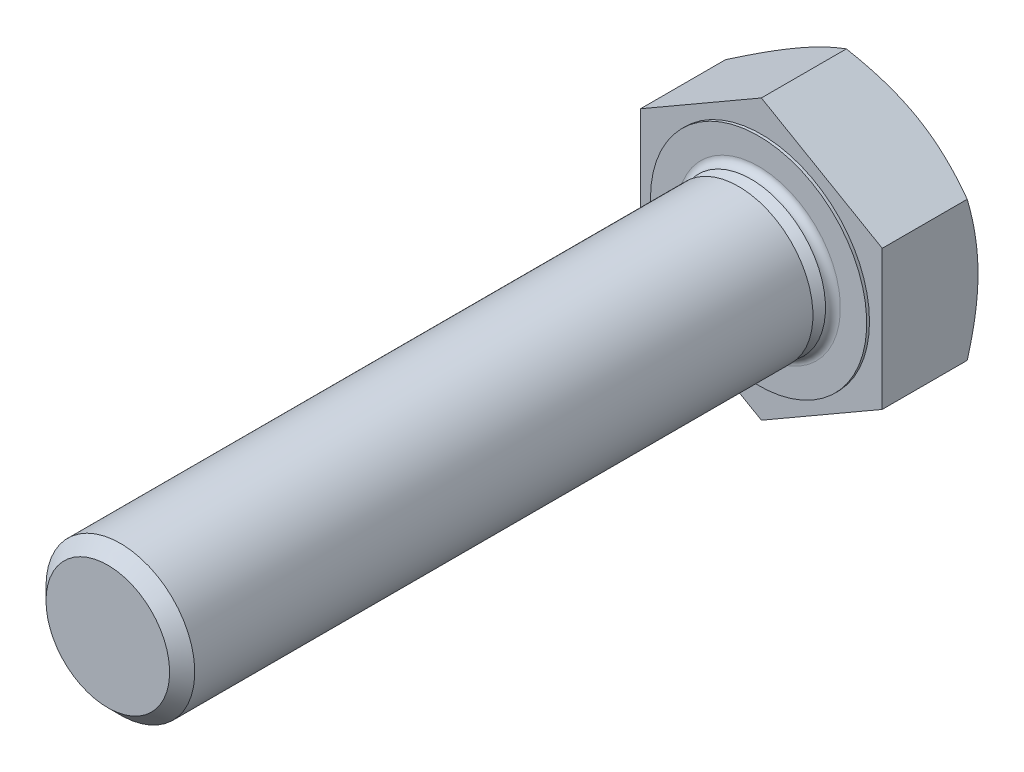
ISO-10303-21;
HEADER;
FILE_DESCRIPTION(('STEP AP214'),'2;1');
FILE_NAME('part.step','',(''),(''),'','','');
FILE_SCHEMA(('AUTOMOTIVE_DESIGN { 1 0 10303 214 1 1 1 1 }'));
ENDSEC;
DATA;
#1=APPLICATION_CONTEXT('core data for automotive mechanical design processes');
#2=APPLICATION_PROTOCOL_DEFINITION('international standard','automotive_design',2000,#1);
#3=PRODUCT_CONTEXT('',#1,'mechanical');
#4=PRODUCT('Part','Part','',(#3));
#5=PRODUCT_RELATED_PRODUCT_CATEGORY('part','',(#4));
#6=PRODUCT_DEFINITION_FORMATION('','',#4);
#7=PRODUCT_DEFINITION_CONTEXT('part definition',#1,'design');
#8=PRODUCT_DEFINITION('design','',#6,#7);
#9=PRODUCT_DEFINITION_SHAPE('','',#8);
#10=(LENGTH_UNIT() NAMED_UNIT(*) SI_UNIT(.MILLI.,.METRE.));
#11=(NAMED_UNIT(*) PLANE_ANGLE_UNIT() SI_UNIT($,.RADIAN.));
#12=(NAMED_UNIT(*) SI_UNIT($,.STERADIAN.) SOLID_ANGLE_UNIT());
#13=UNCERTAINTY_MEASURE_WITH_UNIT(LENGTH_MEASURE(1.E-05),#10,'distance_accuracy_value','');
#14=(GEOMETRIC_REPRESENTATION_CONTEXT(3) GLOBAL_UNCERTAINTY_ASSIGNED_CONTEXT((#13)) GLOBAL_UNIT_ASSIGNED_CONTEXT((#10,
#11,#12)) REPRESENTATION_CONTEXT('',''));
#15=CARTESIAN_POINT('',(0.,0.,0.));
#16=DIRECTION('',(0.,0.,1.));
#17=DIRECTION('',(1.,0.,0.));
#18=AXIS2_PLACEMENT_3D('',#15,#16,#17);
#19=CARTESIAN_POINT('',(0.,0.,35.));
#20=DIRECTION('',(0.,0.,-1.));
#21=DIRECTION('',(-1.,0.,0.));
#22=AXIS2_PLACEMENT_3D('',#19,#20,#21);
#23=PLANE('',#22);
#24=CARTESIAN_POINT('',(0.,0.,35.));
#25=DIRECTION('',(0.,0.,-1.));
#26=DIRECTION('',(-1.,0.,0.));
#27=AXIS2_PLACEMENT_3D('',#24,#25,#26);
#28=CIRCLE('',#27,3.3234375);
#29=CARTESIAN_POINT('',(-3.3234375,0.,35.));
#30=VERTEX_POINT('',#29);
#31=EDGE_CURVE('E11',#30,#30,#28,.T.);
#32=ORIENTED_EDGE('',*,*,#31,.F.);
#33=EDGE_LOOP('',(#32));
#34=FACE_BOUND('',#33,.T.);
#35=ADVANCED_FACE('F17',(#34),#23,.F.);
#36=CARTESIAN_POINT('',(0.,0.,35.));
#37=DIRECTION('',(0.,0.,-1.));
#38=DIRECTION('',(-1.,0.,0.));
#39=AXIS2_PLACEMENT_3D('',#36,#37,#38);
#40=CONICAL_SURFACE('',#39,3.3234375,0.785398163397447);
#41=CARTESIAN_POINT('',(0.,0.,34.3234375));
#42=DIRECTION('',(0.,0.,-1.));
#43=DIRECTION('',(-1.,0.,0.));
#44=AXIS2_PLACEMENT_3D('',#41,#42,#43);
#45=CIRCLE('',#44,4.);
#46=CARTESIAN_POINT('',(-4.,0.,34.3234375));
#47=VERTEX_POINT('',#46);
#48=EDGE_CURVE('E26',#47,#47,#45,.T.);
#49=ORIENTED_EDGE('',*,*,#48,.F.);
#50=EDGE_LOOP('',(#49));
#51=FACE_BOUND('',#50,.T.);
#52=ORIENTED_EDGE('',*,*,#31,.T.);
#53=EDGE_LOOP('',(#52));
#54=FACE_BOUND('',#53,.T.);
#55=ADVANCED_FACE('F209',(#51,#54),#40,.T.);
#56=CARTESIAN_POINT('',(0.,0.,-0.65));
#57=DIRECTION('',(0.,0.,-1.));
#58=DIRECTION('',(-1.,0.,0.));
#59=AXIS2_PLACEMENT_3D('',#56,#57,#58);
#60=CYLINDRICAL_SURFACE('',#59,4.);
#61=CARTESIAN_POINT('',(0.,0.,1.0765625));
#62=DIRECTION('',(0.,0.,-1.));
#63=DIRECTION('',(-1.,0.,0.));
#64=AXIS2_PLACEMENT_3D('',#61,#62,#63);
#65=CIRCLE('',#64,4.);
#66=CARTESIAN_POINT('',(-4.,0.,1.0765625));
#67=VERTEX_POINT('',#66);
#68=EDGE_CURVE('E224',#67,#67,#65,.T.);
#69=ORIENTED_EDGE('',*,*,#68,.F.);
#70=EDGE_LOOP('',(#69));
#71=FACE_BOUND('',#70,.T.);
#72=ORIENTED_EDGE('',*,*,#48,.T.);
#73=EDGE_LOOP('',(#72));
#74=FACE_BOUND('',#73,.T.);
#75=ADVANCED_FACE('F206',(#71,#74),#60,.T.);
#76=CARTESIAN_POINT('',(0.,4.,1.0765625));
#77=DIRECTION('',(0.,0.,1.));
#78=DIRECTION('',(1.,0.,0.));
#79=AXIS2_PLACEMENT_3D('',#76,#77,#78);
#80=PLANE('',#79);
#81=CARTESIAN_POINT('',(0.,0.,1.0765625));
#82=DIRECTION('',(0.,0.,-1.));
#83=DIRECTION('',(-1.,0.,0.));
#84=AXIS2_PLACEMENT_3D('',#81,#82,#83);
#85=CIRCLE('',#84,3.3234375);
#86=CARTESIAN_POINT('',(-3.3234375,0.,1.0765625));
#87=VERTEX_POINT('',#86);
#88=EDGE_CURVE('E231',#87,#87,#85,.T.);
#89=ORIENTED_EDGE('',*,*,#88,.F.);
#90=EDGE_LOOP('',(#89));
#91=FACE_BOUND('',#90,.T.);
#92=ORIENTED_EDGE('',*,*,#68,.T.);
#93=EDGE_LOOP('',(#92));
#94=FACE_BOUND('',#93,.T.);
#95=ADVANCED_FACE('F202',(#91,#94),#80,.F.);
#96=CARTESIAN_POINT('',(0.,0.,1.0765625));
#97=DIRECTION('',(0.,0.,-1.));
#98=DIRECTION('',(-1.,0.,0.));
#99=AXIS2_PLACEMENT_3D('',#96,#97,#98);
#100=CONICAL_SURFACE('',#99,3.3234375,0.785398163397448);
#101=CARTESIAN_POINT('',(0.,0.,0.4));
#102=DIRECTION('',(0.,0.,-1.));
#103=DIRECTION('',(-1.,0.,0.));
#104=AXIS2_PLACEMENT_3D('',#101,#102,#103);
#105=CIRCLE('',#104,4.);
#106=CARTESIAN_POINT('',(-4.,0.,0.4));
#107=VERTEX_POINT('',#106);
#108=EDGE_CURVE('E237',#107,#107,#105,.T.);
#109=ORIENTED_EDGE('',*,*,#108,.F.);
#110=EDGE_LOOP('',(#109));
#111=FACE_BOUND('',#110,.T.);
#112=ORIENTED_EDGE('',*,*,#88,.T.);
#113=EDGE_LOOP('',(#112));
#114=FACE_BOUND('',#113,.T.);
#115=ADVANCED_FACE('F198',(#111,#114),#100,.T.);
#116=CARTESIAN_POINT('',(0.,0.,0.4));
#117=DIRECTION('',(0.,0.,-1.));
#118=DIRECTION('',(-1.,0.,0.));
#119=AXIS2_PLACEMENT_3D('',#116,#117,#118);
#120=TOROIDAL_SURFACE('',#119,4.4,0.4);
#121=ORIENTED_EDGE('',*,*,#108,.T.);
#122=EDGE_LOOP('',(#121));
#123=FACE_BOUND('',#122,.T.);
#124=CARTESIAN_POINT('',(0.,0.,0.));
#125=DIRECTION('',(0.,0.,-1.));
#126=DIRECTION('',(-1.,0.,0.));
#127=AXIS2_PLACEMENT_3D('',#124,#125,#126);
#128=CIRCLE('',#127,4.4);
#129=CARTESIAN_POINT('',(-4.4,0.,0.));
#130=VERTEX_POINT('',#129);
#131=EDGE_CURVE('E241',#130,#130,#128,.T.);
#132=ORIENTED_EDGE('',*,*,#131,.F.);
#133=EDGE_LOOP('',(#132));
#134=FACE_BOUND('',#133,.T.);
#135=ADVANCED_FACE('F194',(#123,#134),#120,.F.);
#136=CARTESIAN_POINT('',(0.,4.4,0.));
#137=DIRECTION('',(0.,0.,-1.));
#138=DIRECTION('',(-1.,0.,0.));
#139=AXIS2_PLACEMENT_3D('',#136,#137,#138);
#140=PLANE('',#139);
#141=CARTESIAN_POINT('',(0.,0.,0.));
#142=DIRECTION('',(0.,0.,-1.));
#143=DIRECTION('',(-1.,0.,0.));
#144=AXIS2_PLACEMENT_3D('',#141,#142,#143);
#145=CIRCLE('',#144,5.815);
#146=CARTESIAN_POINT('',(-5.815,0.,0.));
#147=VERTEX_POINT('',#146);
#148=EDGE_CURVE('E244',#147,#147,#145,.T.);
#149=ORIENTED_EDGE('',*,*,#148,.F.);
#150=EDGE_LOOP('',(#149));
#151=FACE_BOUND('',#150,.T.);
#152=ORIENTED_EDGE('',*,*,#131,.T.);
#153=EDGE_LOOP('',(#152));
#154=FACE_BOUND('',#153,.T.);
#155=ADVANCED_FACE('F190',(#151,#154),#140,.F.);
#156=CARTESIAN_POINT('',(0.,0.,-0.65));
#157=DIRECTION('',(0.,0.,-1.));
#158=DIRECTION('',(-1.,0.,0.));
#159=AXIS2_PLACEMENT_3D('',#156,#157,#158);
#160=CYLINDRICAL_SURFACE('',#159,5.815);
#161=CARTESIAN_POINT('',(0.,0.,-0.15));
#162=DIRECTION('',(0.,0.,1.));
#163=DIRECTION('',(1.,0.,0.));
#164=AXIS2_PLACEMENT_3D('',#161,#162,#163);
#165=CIRCLE('',#164,5.815);
#166=CARTESIAN_POINT('',(5.815,0.,-0.15));
#167=VERTEX_POINT('',#166);
#168=EDGE_CURVE('E20',#167,#167,#165,.T.);
#169=ORIENTED_EDGE('',*,*,#168,.T.);
#170=EDGE_LOOP('',(#169));
#171=FACE_BOUND('',#170,.T.);
#172=ORIENTED_EDGE('',*,*,#148,.T.);
#173=EDGE_LOOP('',(#172));
#174=FACE_BOUND('',#173,.T.);
#175=ADVANCED_FACE('F187',(#171,#174),#160,.T.);
#176=CARTESIAN_POINT('',(0.,0.,-0.15));
#177=DIRECTION('',(0.,0.,1.));
#178=DIRECTION('',(-1.,0.,0.));
#179=AXIS2_PLACEMENT_3D('',#176,#177,#178);
#180=PLANE('',#179);
#181=DIRECTION('',(0.866025403784439,-0.5,0.));
#182=VECTOR('',#181,1.);
#183=CARTESIAN_POINT('',(0.,-7.50555349946514,-0.15));
#184=LINE('',#183,#182);
#185=CARTESIAN_POINT('',(-6.5,-3.75277674973257,-0.15));
#186=VERTEX_POINT('',#185);
#187=CARTESIAN_POINT('',(0.,-7.50555349946514,-0.15));
#188=VERTEX_POINT('',#187);
#189=EDGE_CURVE('E268',#186,#188,#184,.T.);
#190=ORIENTED_EDGE('',*,*,#189,.T.);
#191=DIRECTION('',(0.866025403784439,0.5,0.));
#192=VECTOR('',#191,1.);
#193=CARTESIAN_POINT('',(6.5,-3.75277674973256,-0.15));
#194=LINE('',#193,#192);
#195=CARTESIAN_POINT('',(6.5,-3.75277674973256,-0.15));
#196=VERTEX_POINT('',#195);
#197=EDGE_CURVE('E101',#188,#196,#194,.T.);
#198=ORIENTED_EDGE('',*,*,#197,.T.);
#199=DIRECTION('',(0.,1.,0.));
#200=VECTOR('',#199,1.);
#201=CARTESIAN_POINT('',(6.5,3.75277674973257,-0.15));
#202=LINE('',#201,#200);
#203=CARTESIAN_POINT('',(6.5,3.75277674973257,-0.15));
#204=VERTEX_POINT('',#203);
#205=EDGE_CURVE('E97',#196,#204,#202,.T.);
#206=ORIENTED_EDGE('',*,*,#205,.T.);
#207=DIRECTION('',(-0.866025403784439,0.5,0.));
#208=VECTOR('',#207,1.);
#209=CARTESIAN_POINT('',(0.,7.50555349946514,-0.15));
#210=LINE('',#209,#208);
#211=CARTESIAN_POINT('',(0.,7.50555349946514,-0.15));
#212=VERTEX_POINT('',#211);
#213=EDGE_CURVE('E109',#204,#212,#210,.T.);
#214=ORIENTED_EDGE('',*,*,#213,.T.);
#215=DIRECTION('',(-0.866025403784439,-0.5,0.));
#216=VECTOR('',#215,1.);
#217=CARTESIAN_POINT('',(-6.5,3.75277674973256,-0.15));
#218=LINE('',#217,#216);
#219=CARTESIAN_POINT('',(-6.5,3.75277674973256,-0.15));
#220=VERTEX_POINT('',#219);
#221=EDGE_CURVE('E293',#212,#220,#218,.T.);
#222=ORIENTED_EDGE('',*,*,#221,.T.);
#223=DIRECTION('',(0.,-1.,0.));
#224=VECTOR('',#223,1.);
#225=CARTESIAN_POINT('',(-6.5,-3.75277674973257,-0.15));
#226=LINE('',#225,#224);
#227=EDGE_CURVE('E272',#220,#186,#226,.T.);
#228=ORIENTED_EDGE('',*,*,#227,.T.);
#229=EDGE_LOOP('',(#190,#198,#206,#214,#222,#228));
#230=FACE_BOUND('',#229,.T.);
#231=ORIENTED_EDGE('',*,*,#168,.F.);
#232=EDGE_LOOP('',(#231));
#233=FACE_BOUND('',#232,.T.);
#234=ADVANCED_FACE('F142',(#230,#233),#180,.T.);
#235=CARTESIAN_POINT('',(0.,0.,-4.71831960379145));
#236=DIRECTION('',(0.,0.,1.));
#237=DIRECTION('',(-1.,0.,0.));
#238=AXIS2_PLACEMENT_3D('',#235,#236,#237);
#239=CONICAL_SURFACE('',#238,7.5075,1.0471975511966);
#240=CARTESIAN_POINT('',(0.,0.,-5.3));
#241=DIRECTION('',(0.,0.,1.));
#242=DIRECTION('',(-1.,0.,0.));
#243=AXIS2_PLACEMENT_3D('',#240,#241,#242);
#244=CIRCLE('',#243,6.5);
#245=CARTESIAN_POINT('',(-3.25,-5.62916512459885,-5.3));
#246=VERTEX_POINT('',#245);
#247=CARTESIAN_POINT('',(3.25,-5.62916512459885,-5.3));
#248=VERTEX_POINT('',#247);
#249=EDGE_CURVE('E315',#246,#248,#244,.T.);
#250=ORIENTED_EDGE('',*,*,#249,.T.);
#251=CARTESIAN_POINT('',(6.500002,-3.75277559503203,-4.71944274973241));
#252=CARTESIAN_POINT('',(6.35712620807255,-3.83526497196202,-4.76705884776377));
#253=CARTESIAN_POINT('',(6.21371770790945,-3.91806190813526,-4.81251377350587));
#254=CARTESIAN_POINT('',(5.92573609642413,-4.08432816904797,-4.89850607721118));
#255=CARTESIAN_POINT('',(5.7811625111712,-4.16779776741146,-4.93904133382286));
#256=CARTESIAN_POINT('',(5.34512711287665,-4.41954292199303,-5.05247188162342));
#257=CARTESIAN_POINT('',(5.05194417472151,-4.5888121702587,-5.11698888095725));
#258=CARTESIAN_POINT('',(4.61320127712687,-4.84212050029,-5.19264087408676));
#259=CARTESIAN_POINT('',(4.4689521086707,-4.92540279652855,-5.21419158213611));
#260=CARTESIAN_POINT('',(4.17980207578691,-5.0923436458502,-5.25032811462334));
#261=CARTESIAN_POINT('',(4.03490127008031,-5.1760021650307,-5.26491455442239));
#262=CARTESIAN_POINT('',(3.74484807874235,-5.34346445312898,-5.28675081186109));
#263=CARTESIAN_POINT('',(3.59969616666321,-5.42726794864126,-5.29400895467767));
#264=CARTESIAN_POINT('',(3.30926637478267,-5.59494766716417,-5.3010407782254));
#265=CARTESIAN_POINT('',(3.163988499013,-5.6788238878471,-5.30081469025906));
#266=CARTESIAN_POINT('',(2.76599917400351,-5.90860313177592,-5.28990852719947));
#267=CARTESIAN_POINT('',(2.51341807956326,-6.05443089464321,-5.27160906821291));
#268=CARTESIAN_POINT('',(2.0099334678803,-6.3451178707312,-5.21358751925144));
#269=CARTESIAN_POINT('',(1.75903172059244,-6.48997606206799,-5.17384560824828));
#270=CARTESIAN_POINT('',(1.25453430247847,-6.78124778222157,-5.0745047971726));
#271=CARTESIAN_POINT('',(1.00100227202879,-6.92762456824988,-5.014485106267));
#272=CARTESIAN_POINT('',(0.497718540867834,-7.21819556591442,-4.87826555818941));
#273=CARTESIAN_POINT('',(0.247960397480241,-7.36239349723155,-4.8020976871334));
#274=CARTESIAN_POINT('',(-2.00000000056936E-06,-7.50555465416567,-4.71944274973241));
#275=B_SPLINE_CURVE_WITH_KNOTS('',3,(#251,#252,#253,#254,#255,#256,#257,#258,#259,#260,#261,
#262,#263,#264,#265,#266,#267,#268,#269,#270,#271,#272,#273,#274),.UNSPECIFIED.,.F.,.F.,(4,2,2,
2,2,2,2,2,2,2,2,4),(0.,0.515097230812099,1.03041578730196,2.06319381753069,2.56693508465116,
3.07063183306576,3.5737557200387,4.07686405782423,4.95263248446346,5.82921184659663,
6.72522956997887,7.61948878328294),.UNSPECIFIED.);
#276=CARTESIAN_POINT('',(0.,-7.50555349946514,-4.71944341639924));
#277=VERTEX_POINT('',#276);
#278=EDGE_CURVE('E33',#248,#277,#275,.T.);
#279=ORIENTED_EDGE('',*,*,#278,.T.);
#280=CARTESIAN_POINT('',(2.00000000078336E-06,-7.50555465416567,-4.71944274973241));
#281=CARTESIAN_POINT('',(-0.142873791927456,-7.42306527723568,-4.76705884776377));
#282=CARTESIAN_POINT('',(-0.286282292090552,-7.34026834106244,-4.81251377350587));
#283=CARTESIAN_POINT('',(-0.574263903575868,-7.17400208014973,-4.89850607721118));
#284=CARTESIAN_POINT('',(-0.718837488828803,-7.09053248178624,-4.93904133382286));
#285=CARTESIAN_POINT('',(-1.15487288712335,-6.83878732720467,-5.05247188162342));
#286=CARTESIAN_POINT('',(-1.44805582527849,-6.669518078939,-5.11698888095725));
#287=CARTESIAN_POINT('',(-1.88679872287313,-6.4162097489077,-5.19264087408676));
#288=CARTESIAN_POINT('',(-2.03104789132931,-6.33292745266914,-5.21419158213611));
#289=CARTESIAN_POINT('',(-2.32019792421309,-6.1659866033475,-5.25032811462334));
#290=CARTESIAN_POINT('',(-2.46509872991969,-6.082328084167,-5.26491455442238));
#291=CARTESIAN_POINT('',(-2.75515192125765,-5.91486579606872,-5.28675081186109));
#292=CARTESIAN_POINT('',(-2.9003038333368,-5.83106230055644,-5.29400895467766));
#293=CARTESIAN_POINT('',(-3.19073362521733,-5.66338258203352,-5.30104077822539));
#294=CARTESIAN_POINT('',(-3.33601150098701,-5.5795063613506,-5.30081469025906));
#295=CARTESIAN_POINT('',(-3.73400082599649,-5.34972711742178,-5.28990852719947));
#296=CARTESIAN_POINT('',(-3.98658192043674,-5.20389935455449,-5.2716090682129));
#297=CARTESIAN_POINT('',(-4.4900665321197,-4.9132123784665,-5.21358751925144));
#298=CARTESIAN_POINT('',(-4.74096827940756,-4.76835418712971,-5.17384560824827));
#299=CARTESIAN_POINT('',(-5.24546569752153,-4.47708246697614,-5.0745047971726));
#300=CARTESIAN_POINT('',(-5.49899772797121,-4.33070568094782,-5.014485106267));
#301=CARTESIAN_POINT('',(-6.00228145913217,-4.04013468328328,-4.8782655581894));
#302=CARTESIAN_POINT('',(-6.25203960251976,-3.89593675196616,-4.8020976871334));
#303=CARTESIAN_POINT('',(-6.500002,-3.75277559503203,-4.71944274973241));
#304=B_SPLINE_CURVE_WITH_KNOTS('',3,(#280,#281,#282,#283,#284,#285,#286,#287,#288,#289,#290,
#291,#292,#293,#294,#295,#296,#297,#298,#299,#300,#301,#302,#303),.UNSPECIFIED.,.F.,.F.,(4,2,2,
2,2,2,2,2,2,2,2,4),(0.,0.515097230812099,1.03041578730196,2.06319381753069,2.56693508465116,
3.07063183306576,3.5737557200387,4.07686405782423,4.95263248446346,5.82921184659663,
6.72522956997887,7.61948878328294),.UNSPECIFIED.);
#305=EDGE_CURVE('E172',#277,#246,#304,.T.);
#306=ORIENTED_EDGE('',*,*,#305,.T.);
#307=EDGE_LOOP('',(#250,#279,#306));
#308=FACE_BOUND('',#307,.T.);
#309=ADVANCED_FACE('F140',(#308),#239,.T.);
#310=CARTESIAN_POINT('',(6.5,0.,-5.3));
#311=VERTEX_POINT('',#310);
#312=CARTESIAN_POINT('',(3.25,5.62916512459885,-5.3));
#313=VERTEX_POINT('',#312);
#314=EDGE_CURVE('E333',#311,#313,#244,.T.);
#315=ORIENTED_EDGE('',*,*,#314,.T.);
#316=CARTESIAN_POINT('',(-2.00000000097541E-06,7.50555465416567,-4.71944274973241));
#317=CARTESIAN_POINT('',(0.142873791927456,7.42306527723568,-4.76705884776377));
#318=CARTESIAN_POINT('',(0.286282292090551,7.34026834106244,-4.81251377350587));
#319=CARTESIAN_POINT('',(0.574263903575868,7.17400208014973,-4.89850607721118));
#320=CARTESIAN_POINT('',(0.718837488828802,7.09053248178624,-4.93904133382286));
#321=CARTESIAN_POINT('',(1.15487288712335,6.83878732720467,-5.05247188162342));
#322=CARTESIAN_POINT('',(1.44805582527849,6.669518078939,-5.11698888095725));
#323=CARTESIAN_POINT('',(1.88679872287313,6.4162097489077,-5.19264087408676));
#324=CARTESIAN_POINT('',(2.03104789132931,6.33292745266914,-5.21419158213611));
#325=CARTESIAN_POINT('',(2.32019792421309,6.1659866033475,-5.25032811462334));
#326=CARTESIAN_POINT('',(2.46509872991969,6.082328084167,-5.26491455442238));
#327=CARTESIAN_POINT('',(2.75515192125765,5.91486579606872,-5.28675081186109));
#328=CARTESIAN_POINT('',(2.90030383333679,5.83106230055644,-5.29400895467766));
#329=CARTESIAN_POINT('',(3.19073362521733,5.66338258203352,-5.30104077822539));
#330=CARTESIAN_POINT('',(3.33601150098701,5.5795063613506,-5.30081469025906));
#331=CARTESIAN_POINT('',(3.73400082599649,5.34972711742178,-5.28990852719947));
#332=CARTESIAN_POINT('',(3.98658192043674,5.20389935455449,-5.2716090682129));
#333=CARTESIAN_POINT('',(4.4900665321197,4.9132123784665,-5.21358751925144));
#334=CARTESIAN_POINT('',(4.74096827940756,4.76835418712971,-5.17384560824827));
#335=CARTESIAN_POINT('',(5.24546569752153,4.47708246697614,-5.0745047971726));
#336=CARTESIAN_POINT('',(5.49899772797121,4.33070568094782,-5.014485106267));
#337=CARTESIAN_POINT('',(6.00228145913216,4.04013468328329,-4.8782655581894));
#338=CARTESIAN_POINT('',(6.25203960251976,3.89593675196616,-4.8020976871334));
#339=CARTESIAN_POINT('',(6.500002,3.75277559503204,-4.71944274973241));
#340=B_SPLINE_CURVE_WITH_KNOTS('',3,(#316,#317,#318,#319,#320,#321,#322,#323,#324,#325,#326,
#327,#328,#329,#330,#331,#332,#333,#334,#335,#336,#337,#338,#339),.UNSPECIFIED.,.F.,.F.,(4,2,2,
2,2,2,2,2,2,2,2,4),(0.,0.515097230812098,1.03041578730196,2.06319381753069,2.56693508465116,
3.07063183306576,3.5737557200387,4.07686405782423,4.95263248446345,5.82921184659662,
6.72522956997886,7.61948878328294),.UNSPECIFIED.);
#341=CARTESIAN_POINT('',(6.5,3.75277674973258,-4.71944341639923));
#342=VERTEX_POINT('',#341);
#343=EDGE_CURVE('E148',#313,#342,#340,.T.);
#344=ORIENTED_EDGE('',*,*,#343,.T.);
#345=CARTESIAN_POINT('',(6.5,9.95307285908936,-2.18950106586408));
#346=CARTESIAN_POINT('',(6.5,9.66768488978744,-2.32741694462484));
#347=CARTESIAN_POINT('',(6.5,9.38162218475458,-2.46396187262551));
#348=CARTESIAN_POINT('',(6.5,8.80778247979371,-2.73352642358591));
#349=CARTESIAN_POINT('',(6.5,8.52000519349762,-2.86654543621498));
#350=CARTESIAN_POINT('',(6.5,7.94081702987502,-3.12897547035034));
#351=CARTESIAN_POINT('',(6.5,7.64939478323307,-3.25836149012832));
#352=CARTESIAN_POINT('',(6.5,7.0641550965755,-3.51157630682606));
#353=CARTESIAN_POINT('',(6.5,6.77033778235015,-3.63540539340508));
#354=CARTESIAN_POINT('',(6.5,6.17619249466497,-3.87749909631481));
#355=CARTESIAN_POINT('',(6.5,5.875828877051,-3.99567671308662));
#356=CARTESIAN_POINT('',(6.5,5.27155865332413,-4.22277662595523));
#357=CARTESIAN_POINT('',(6.5,4.96765165730143,-4.33169789235064));
#358=CARTESIAN_POINT('',(6.5,4.35643639784011,-4.53735883659428));
#359=CARTESIAN_POINT('',(6.5,4.04913693634067,-4.63412441108149));
#360=CARTESIAN_POINT('',(6.5,3.43016616038199,-4.81233031373957));
#361=CARTESIAN_POINT('',(6.5,3.11849626203734,-4.89377548814036));
#362=CARTESIAN_POINT('',(6.5,2.49058681273854,-5.03739091972401));
#363=CARTESIAN_POINT('',(6.5,2.17434607035872,-5.099556053006));
#364=CARTESIAN_POINT('',(6.5,1.53800734029216,-5.20041039162963));
#365=CARTESIAN_POINT('',(6.5,1.21790934922361,-5.23909957638743));
#366=CARTESIAN_POINT('',(6.5,0.737252871284547,-5.27704622673573));
#367=CARTESIAN_POINT('',(6.5,0.577446868410653,-5.28634917626868));
#368=CARTESIAN_POINT('',(6.5,0.257576967669788,-5.29818345264611));
#369=CARTESIAN_POINT('',(6.5,0.0975130731795747,-5.30071486744556));
#370=CARTESIAN_POINT('',(6.5,-0.222530422340147,-5.29893807889715));
#371=CARTESIAN_POINT('',(6.5,-0.382510034418972,-5.29463179526148));
#372=CARTESIAN_POINT('',(6.5,-0.702148832131736,-5.27928875033018));
#373=CARTESIAN_POINT('',(6.5,-0.861808001361578,-5.268251652865));
#374=CARTESIAN_POINT('',(6.5,-1.2487675251381,-5.2335743026679));
#375=CARTESIAN_POINT('',(6.5,-1.47577055977927,-5.20656168522891));
#376=CARTESIAN_POINT('',(6.5,-1.92803729286359,-5.14042863403666));
#377=CARTESIAN_POINT('',(6.5,-2.15330049935344,-5.1013048955893));
#378=CARTESIAN_POINT('',(6.5,-2.60190162254787,-5.01233712827938));
#379=CARTESIAN_POINT('',(6.5,-2.82523750985594,-4.96248296370137));
#380=CARTESIAN_POINT('',(6.5,-3.26961152922598,-4.85357548053456));
#381=CARTESIAN_POINT('',(6.5,-3.49064987565262,-4.79452302853169));
#382=CARTESIAN_POINT('',(6.5,-3.93587314871608,-4.6670880522278));
#383=CARTESIAN_POINT('',(6.5,-4.16000238632251,-4.59851230201414));
#384=CARTESIAN_POINT('',(6.5,-4.60589181343481,-4.45458478908547));
#385=CARTESIAN_POINT('',(6.50000000000001,-4.82765352051654,-4.37923769993311));
#386=CARTESIAN_POINT('',(6.50000000000001,-5.26791804038342,-4.22332390471417));
#387=CARTESIAN_POINT('',(6.50000000000001,-5.48643217049916,-4.14278896471665));
#388=CARTESIAN_POINT('',(6.5,-5.92176503585598,-3.97699192799453));
#389=CARTESIAN_POINT('',(6.5,-6.13858304495037,-3.89172792084594));
#390=CARTESIAN_POINT('',(6.5,-6.35461336357442,-3.80456718200001));
#391=B_SPLINE_CURVE_WITH_KNOTS('',3,(#345,#346,#347,#348,#349,#350,#351,#352,#353,#354,#355,
#356,#357,#358,#359,#360,#361,#362,#363,#364,#365,#366,#367,#368,#369,#370,#371,#372,#373,#374,
#375,#376,#377,#378,#379,#380,#381,#382,#383,#384,#385,#386,#387,#388,#389,#390),.UNSPECIFIED.,
.F.,.F.,(4,2,2,2,2,2,2,2,2,2,2,2,2,2,2,2,2,2,2,2,2,2,4),(0.,0.950909051370077,1.90198164276349,
2.85849656625616,3.8149615726478,4.78317137315415,5.75148873932466,6.71770688363887,
7.68361887285433,8.64978734516564,9.61595666461727,10.0960644432439,10.5761659857554,
11.0561327615996,11.5361235112802,12.2215554610679,12.9071746059577,13.5934442356332,
14.2796492497687,14.982675389883,15.6852199758561,16.3838102365337,17.0826847952346),.UNSPECIFIED.);
#392=EDGE_CURVE('E114',#342,#311,#391,.T.);
#393=ORIENTED_EDGE('',*,*,#392,.T.);
#394=EDGE_LOOP('',(#315,#344,#393));
#395=FACE_BOUND('',#394,.T.);
#396=ADVANCED_FACE('F141',(#395),#239,.T.);
#397=CARTESIAN_POINT('',(-3.25,5.62916512459885,-5.3));
#398=VERTEX_POINT('',#397);
#399=EDGE_CURVE('E337',#313,#398,#244,.T.);
#400=ORIENTED_EDGE('',*,*,#399,.T.);
#401=CARTESIAN_POINT('',(-6.500002,3.75277559503203,-4.71944274973241));
#402=CARTESIAN_POINT('',(-6.35712620807255,3.83526497196203,-4.76705884776377));
#403=CARTESIAN_POINT('',(-6.21371770790945,3.91806190813527,-4.81251377350587));
#404=CARTESIAN_POINT('',(-5.92573609642413,4.08432816904798,-4.89850607721118));
#405=CARTESIAN_POINT('',(-5.7811625111712,4.16779776741147,-4.93904133382286));
#406=CARTESIAN_POINT('',(-5.34512711287665,4.41954292199303,-5.05247188162342));
#407=CARTESIAN_POINT('',(-5.05194417472151,4.5888121702587,-5.11698888095725));
#408=CARTESIAN_POINT('',(-4.61320127712688,4.84212050029,-5.19264087408676));
#409=CARTESIAN_POINT('',(-4.4689521086707,4.92540279652856,-5.21419158213611));
#410=CARTESIAN_POINT('',(-4.17980207578691,5.0923436458502,-5.25032811462334));
#411=CARTESIAN_POINT('',(-4.03490127008031,5.1760021650307,-5.26491455442239));
#412=CARTESIAN_POINT('',(-3.74484807874235,5.34346445312898,-5.28675081186109));
#413=CARTESIAN_POINT('',(-3.59969616666321,5.42726794864126,-5.29400895467766));
#414=CARTESIAN_POINT('',(-3.30926637478268,5.59494766716418,-5.30104077822539));
#415=CARTESIAN_POINT('',(-3.163988499013,5.6788238878471,-5.30081469025906));
#416=CARTESIAN_POINT('',(-2.76599917400351,5.90860313177592,-5.28990852719947));
#417=CARTESIAN_POINT('',(-2.51341807956326,6.05443089464321,-5.27160906821291));
#418=CARTESIAN_POINT('',(-2.0099334678803,6.3451178707312,-5.21358751925144));
#419=CARTESIAN_POINT('',(-1.75903172059244,6.48997606206799,-5.17384560824827));
#420=CARTESIAN_POINT('',(-1.25453430247847,6.78124778222157,-5.0745047971726));
#421=CARTESIAN_POINT('',(-1.00100227202879,6.92762456824988,-5.014485106267));
#422=CARTESIAN_POINT('',(-0.497718540867836,7.21819556591442,-4.87826555818941));
#423=CARTESIAN_POINT('',(-0.247960397480243,7.36239349723155,-4.8020976871334));
#424=CARTESIAN_POINT('',(1.99999999882913E-06,7.50555465416567,-4.71944274973241));
#425=B_SPLINE_CURVE_WITH_KNOTS('',3,(#401,#402,#403,#404,#405,#406,#407,#408,#409,#410,#411,
#412,#413,#414,#415,#416,#417,#418,#419,#420,#421,#422,#423,#424),.UNSPECIFIED.,.F.,.F.,(4,2,2,
2,2,2,2,2,2,2,2,4),(0.,0.515097230812099,1.03041578730196,2.06319381753069,2.56693508465116,
3.07063183306576,3.57375572003869,4.07686405782423,4.95263248446345,5.82921184659662,
6.72522956997887,7.61948878328294),.UNSPECIFIED.);
#426=CARTESIAN_POINT('',(0.,7.50555349946514,-4.71944341639923));
#427=VERTEX_POINT('',#426);
#428=EDGE_CURVE('E155',#398,#427,#425,.T.);
#429=ORIENTED_EDGE('',*,*,#428,.T.);
#430=EDGE_CURVE('E340',#427,#313,#340,.T.);
#431=ORIENTED_EDGE('',*,*,#430,.T.);
#432=EDGE_LOOP('',(#400,#429,#431));
#433=FACE_BOUND('',#432,.T.);
#434=ADVANCED_FACE('F327',(#433),#239,.T.);
#435=CARTESIAN_POINT('',(-6.5,0.,-5.3));
#436=VERTEX_POINT('',#435);
#437=EDGE_CURVE('E355',#398,#436,#244,.T.);
#438=ORIENTED_EDGE('',*,*,#437,.T.);
#439=CARTESIAN_POINT('',(-6.5,9.95307285908935,-2.18950106586408));
#440=CARTESIAN_POINT('',(-6.5,9.66768488978743,-2.32741694462485));
#441=CARTESIAN_POINT('',(-6.5,9.38162218475457,-2.46396187262552));
#442=CARTESIAN_POINT('',(-6.5,8.80778247979371,-2.73352642358591));
#443=CARTESIAN_POINT('',(-6.5,8.52000519349762,-2.86654543621498));
#444=CARTESIAN_POINT('',(-6.5,7.94081702987501,-3.12897547035034));
#445=CARTESIAN_POINT('',(-6.5,7.64939478323306,-3.25836149012832));
#446=CARTESIAN_POINT('',(-6.5,7.06415509657549,-3.51157630682606));
#447=CARTESIAN_POINT('',(-6.5,6.77033778235014,-3.63540539340508));
#448=CARTESIAN_POINT('',(-6.5,6.17619249466496,-3.87749909631481));
#449=CARTESIAN_POINT('',(-6.5,5.875828877051,-3.99567671308663));
#450=CARTESIAN_POINT('',(-6.5,5.27155865332413,-4.22277662595523));
#451=CARTESIAN_POINT('',(-6.5,4.96765165730142,-4.33169789235064));
#452=CARTESIAN_POINT('',(-6.5,4.3564363978401,-4.53735883659429));
#453=CARTESIAN_POINT('',(-6.5,4.04913693634066,-4.63412441108148));
#454=CARTESIAN_POINT('',(-6.5,3.43016616038199,-4.81233031373958));
#455=CARTESIAN_POINT('',(-6.5,3.11849626203734,-4.89377548814037));
#456=CARTESIAN_POINT('',(-6.5,2.49058681273853,-5.03739091972402));
#457=CARTESIAN_POINT('',(-6.5,2.17434607035871,-5.099556053006));
#458=CARTESIAN_POINT('',(-6.5,1.53800734029216,-5.20041039162963));
#459=CARTESIAN_POINT('',(-6.5,1.21790934922361,-5.23909957638743));
#460=CARTESIAN_POINT('',(-6.5,0.737252871284539,-5.27704622673573));
#461=CARTESIAN_POINT('',(-6.5,0.577446868410645,-5.28634917626868));
#462=CARTESIAN_POINT('',(-6.5,0.257576967669781,-5.29818345264611));
#463=CARTESIAN_POINT('',(-6.5,0.0975130731795681,-5.30071486744556));
#464=CARTESIAN_POINT('',(-6.5,-0.222530422340154,-5.29893807889715));
#465=CARTESIAN_POINT('',(-6.5,-0.382510034418979,-5.29463179526148));
#466=CARTESIAN_POINT('',(-6.5,-0.702148832131743,-5.27928875033018));
#467=CARTESIAN_POINT('',(-6.5,-0.861808001361585,-5.26825165286501));
#468=CARTESIAN_POINT('',(-6.5,-1.24876752513811,-5.23357430266791));
#469=CARTESIAN_POINT('',(-6.5,-1.47577055977927,-5.20656168522891));
#470=CARTESIAN_POINT('',(-6.5,-1.9280372928636,-5.14042863403666));
#471=CARTESIAN_POINT('',(-6.5,-2.15330049935345,-5.1013048955893));
#472=CARTESIAN_POINT('',(-6.5,-2.60190162254787,-5.01233712827938));
#473=CARTESIAN_POINT('',(-6.5,-2.82523750985594,-4.96248296370137));
#474=CARTESIAN_POINT('',(-6.5,-3.26961152922599,-4.85357548053456));
#475=CARTESIAN_POINT('',(-6.5,-3.49064987565262,-4.7945230285317));
#476=CARTESIAN_POINT('',(-6.5,-3.93587314871608,-4.66708805222781));
#477=CARTESIAN_POINT('',(-6.5,-4.16000238632252,-4.59851230201414));
#478=CARTESIAN_POINT('',(-6.5,-4.60589181343481,-4.45458478908547));
#479=CARTESIAN_POINT('',(-6.5,-4.82765352051654,-4.37923769993311));
#480=CARTESIAN_POINT('',(-6.5,-5.26791804038343,-4.22332390471417));
#481=CARTESIAN_POINT('',(-6.5,-5.48643217049916,-4.14278896471665));
#482=CARTESIAN_POINT('',(-6.5,-5.92176503585599,-3.97699192799453));
#483=CARTESIAN_POINT('',(-6.5,-6.13858304495038,-3.89172792084594));
#484=CARTESIAN_POINT('',(-6.5,-6.35461336357443,-3.80456718200001));
#485=B_SPLINE_CURVE_WITH_KNOTS('',3,(#439,#440,#441,#442,#443,#444,#445,#446,#447,#448,#449,
#450,#451,#452,#453,#454,#455,#456,#457,#458,#459,#460,#461,#462,#463,#464,#465,#466,#467,#468,
#469,#470,#471,#472,#473,#474,#475,#476,#477,#478,#479,#480,#481,#482,#483,#484),.UNSPECIFIED.,
.F.,.F.,(4,2,2,2,2,2,2,2,2,2,2,2,2,2,2,2,2,2,2,2,2,2,4),(0.,0.950909051370074,1.90198164276349,
2.85849656625615,3.8149615726478,4.78317137315414,5.75148873932466,6.71770688363887,
7.68361887285432,8.64978734516564,9.61595666461727,10.0960644432439,10.5761659857554,
11.0561327615996,11.5361235112802,12.2215554610679,12.9071746059577,13.5934442356332,
14.2796492497687,14.982675389883,15.6852199758561,16.3838102365337,17.0826847952346),.UNSPECIFIED.);
#486=CARTESIAN_POINT('',(-6.5,3.75277674973256,-4.71944341639923));
#487=VERTEX_POINT('',#486);
#488=EDGE_CURVE('E161',#436,#487,#485,.F.);
#489=ORIENTED_EDGE('',*,*,#488,.T.);
#490=EDGE_CURVE('E359',#487,#398,#425,.T.);
#491=ORIENTED_EDGE('',*,*,#490,.T.);
#492=EDGE_LOOP('',(#438,#489,#491));
#493=FACE_BOUND('',#492,.T.);
#494=ADVANCED_FACE('F346',(#493),#239,.T.);
#495=EDGE_CURVE('E319',#436,#246,#244,.T.);
#496=ORIENTED_EDGE('',*,*,#495,.T.);
#497=CARTESIAN_POINT('',(-6.5,-3.75277674973257,-4.71944341639923));
#498=VERTEX_POINT('',#497);
#499=EDGE_CURVE('E41',#246,#498,#304,.T.);
#500=ORIENTED_EDGE('',*,*,#499,.T.);
#501=EDGE_CURVE('E173',#498,#436,#485,.F.);
#502=ORIENTED_EDGE('',*,*,#501,.T.);
#503=EDGE_LOOP('',(#496,#500,#502));
#504=FACE_BOUND('',#503,.T.);
#505=ADVANCED_FACE('F308',(#504),#239,.T.);
#506=CARTESIAN_POINT('',(0.,-6.5,-5.3));
#507=DIRECTION('',(0.,0.,-1.));
#508=DIRECTION('',(1.,0.,0.));
#509=AXIS2_PLACEMENT_3D('',#506,#507,#508);
#510=PLANE('',#509);
#511=ORIENTED_EDGE('',*,*,#495,.F.);
#512=ORIENTED_EDGE('',*,*,#437,.F.);
#513=ORIENTED_EDGE('',*,*,#399,.F.);
#514=ORIENTED_EDGE('',*,*,#314,.F.);
#515=EDGE_CURVE('E112',#248,#311,#244,.T.);
#516=ORIENTED_EDGE('',*,*,#515,.F.);
#517=ORIENTED_EDGE('',*,*,#249,.F.);
#518=EDGE_LOOP('',(#511,#512,#513,#514,#516,#517));
#519=FACE_BOUND('',#518,.T.);
#520=ADVANCED_FACE('F139',(#519),#510,.T.);
#521=CARTESIAN_POINT('',(6.5,-3.75277674973256,-4.71944341639923));
#522=VERTEX_POINT('',#521);
#523=EDGE_CURVE('E94',#311,#522,#391,.T.);
#524=ORIENTED_EDGE('',*,*,#523,.T.);
#525=EDGE_CURVE('E103',#522,#248,#275,.T.);
#526=ORIENTED_EDGE('',*,*,#525,.T.);
#527=ORIENTED_EDGE('',*,*,#515,.T.);
#528=EDGE_LOOP('',(#524,#526,#527));
#529=FACE_BOUND('',#528,.T.);
#530=ADVANCED_FACE('F111',(#529),#239,.T.);
#531=CARTESIAN_POINT('',(6.5,-3.75277674973256,-6.3));
#532=DIRECTION('',(-0.5,0.866025403784438,0.));
#533=DIRECTION('',(0.866025403784439,0.5,0.));
#534=AXIS2_PLACEMENT_3D('',#531,#532,#533);
#535=PLANE('',#534);
#536=ORIENTED_EDGE('',*,*,#197,.F.);
#537=DIRECTION('',(0.,0.,1.));
#538=VECTOR('',#537,1.);
#539=CARTESIAN_POINT('',(0.,-7.50555349946514,-6.3));
#540=LINE('',#539,#538);
#541=EDGE_CURVE('E115',#277,#188,#540,.T.);
#542=ORIENTED_EDGE('',*,*,#541,.F.);
#543=ORIENTED_EDGE('',*,*,#278,.F.);
#544=ORIENTED_EDGE('',*,*,#525,.F.);
#545=DIRECTION('',(0.,0.,1.));
#546=VECTOR('',#545,1.);
#547=CARTESIAN_POINT('',(6.5,-3.75277674973256,-6.3));
#548=LINE('',#547,#546);
#549=EDGE_CURVE('E91',#522,#196,#548,.T.);
#550=ORIENTED_EDGE('',*,*,#549,.T.);
#551=EDGE_LOOP('',(#536,#542,#543,#544,#550));
#552=FACE_BOUND('',#551,.T.);
#553=ADVANCED_FACE('F104',(#552),#535,.F.);
#554=CARTESIAN_POINT('',(0.,-7.50555349946514,-6.3));
#555=DIRECTION('',(0.5,0.866025403784439,0.));
#556=DIRECTION('',(0.866025403784439,-0.5,0.));
#557=AXIS2_PLACEMENT_3D('',#554,#555,#556);
#558=PLANE('',#557);
#559=ORIENTED_EDGE('',*,*,#189,.F.);
#560=DIRECTION('',(0.,0.,1.));
#561=VECTOR('',#560,1.);
#562=CARTESIAN_POINT('',(-6.5,-3.75277674973257,-6.3));
#563=LINE('',#562,#561);
#564=EDGE_CURVE('E123',#498,#186,#563,.T.);
#565=ORIENTED_EDGE('',*,*,#564,.F.);
#566=ORIENTED_EDGE('',*,*,#499,.F.);
#567=ORIENTED_EDGE('',*,*,#305,.F.);
#568=ORIENTED_EDGE('',*,*,#541,.T.);
#569=EDGE_LOOP('',(#559,#565,#566,#567,#568));
#570=FACE_BOUND('',#569,.T.);
#571=ADVANCED_FACE('F179',(#570),#558,.F.);
#572=CARTESIAN_POINT('',(-6.5,-3.75277674973257,-6.3));
#573=DIRECTION('',(1.,0.,0.));
#574=DIRECTION('',(0.,-1.,0.));
#575=AXIS2_PLACEMENT_3D('',#572,#573,#574);
#576=PLANE('',#575);
#577=ORIENTED_EDGE('',*,*,#227,.F.);
#578=DIRECTION('',(0.,0.,1.));
#579=VECTOR('',#578,1.);
#580=CARTESIAN_POINT('',(-6.5,3.75277674973256,-6.3));
#581=LINE('',#580,#579);
#582=EDGE_CURVE('E282',#487,#220,#581,.T.);
#583=ORIENTED_EDGE('',*,*,#582,.F.);
#584=ORIENTED_EDGE('',*,*,#488,.F.);
#585=ORIENTED_EDGE('',*,*,#501,.F.);
#586=ORIENTED_EDGE('',*,*,#564,.T.);
#587=EDGE_LOOP('',(#577,#583,#584,#585,#586));
#588=FACE_BOUND('',#587,.T.);
#589=ADVANCED_FACE('F182',(#588),#576,.F.);
#590=CARTESIAN_POINT('',(-6.5,3.75277674973256,-6.3));
#591=DIRECTION('',(0.5,-0.866025403784439,0.));
#592=DIRECTION('',(-0.866025403784439,-0.5,0.));
#593=AXIS2_PLACEMENT_3D('',#590,#591,#592);
#594=PLANE('',#593);
#595=ORIENTED_EDGE('',*,*,#221,.F.);
#596=DIRECTION('',(0.,0.,1.));
#597=VECTOR('',#596,1.);
#598=CARTESIAN_POINT('',(0.,7.50555349946514,-6.3));
#599=LINE('',#598,#597);
#600=EDGE_CURVE('E278',#427,#212,#599,.T.);
#601=ORIENTED_EDGE('',*,*,#600,.F.);
#602=ORIENTED_EDGE('',*,*,#428,.F.);
#603=ORIENTED_EDGE('',*,*,#490,.F.);
#604=ORIENTED_EDGE('',*,*,#582,.T.);
#605=EDGE_LOOP('',(#595,#601,#602,#603,#604));
#606=FACE_BOUND('',#605,.T.);
#607=ADVANCED_FACE('F430',(#606),#594,.F.);
#608=CARTESIAN_POINT('',(0.,7.50555349946514,-6.3));
#609=DIRECTION('',(-0.5,-0.866025403784439,0.));
#610=DIRECTION('',(-0.866025403784439,0.5,0.));
#611=AXIS2_PLACEMENT_3D('',#608,#609,#610);
#612=PLANE('',#611);
#613=ORIENTED_EDGE('',*,*,#213,.F.);
#614=DIRECTION('',(0.,0.,1.));
#615=VECTOR('',#614,1.);
#616=CARTESIAN_POINT('',(6.5,3.75277674973258,-6.3));
#617=LINE('',#616,#615);
#618=EDGE_CURVE('E100',#342,#204,#617,.T.);
#619=ORIENTED_EDGE('',*,*,#618,.F.);
#620=ORIENTED_EDGE('',*,*,#343,.F.);
#621=ORIENTED_EDGE('',*,*,#430,.F.);
#622=ORIENTED_EDGE('',*,*,#600,.T.);
#623=EDGE_LOOP('',(#613,#619,#620,#621,#622));
#624=FACE_BOUND('',#623,.T.);
#625=ADVANCED_FACE('F439',(#624),#612,.F.);
#626=CARTESIAN_POINT('',(6.5,3.75277674973257,-6.3));
#627=DIRECTION('',(-1.,0.,0.));
#628=DIRECTION('',(0.,1.,0.));
#629=AXIS2_PLACEMENT_3D('',#626,#627,#628);
#630=PLANE('',#629);
#631=ORIENTED_EDGE('',*,*,#205,.F.);
#632=ORIENTED_EDGE('',*,*,#549,.F.);
#633=ORIENTED_EDGE('',*,*,#523,.F.);
#634=ORIENTED_EDGE('',*,*,#392,.F.);
#635=ORIENTED_EDGE('',*,*,#618,.T.);
#636=EDGE_LOOP('',(#631,#632,#633,#634,#635));
#637=FACE_BOUND('',#636,.T.);
#638=ADVANCED_FACE('F92',(#637),#630,.F.);
#639=CLOSED_SHELL('',(#35,#55,#75,#95,#115,#135,#155,#175,#234,#309,#396,#434,#494,#505,#520,
#530,#553,#571,#589,#607,#625,#638));
#640=MANIFOLD_SOLID_BREP('B1',#639);
#641=ADVANCED_BREP_SHAPE_REPRESENTATION('',(#18,#640),#14);
#642=SHAPE_DEFINITION_REPRESENTATION(#9,#641);
ENDSEC;
END-ISO-10303-21;
